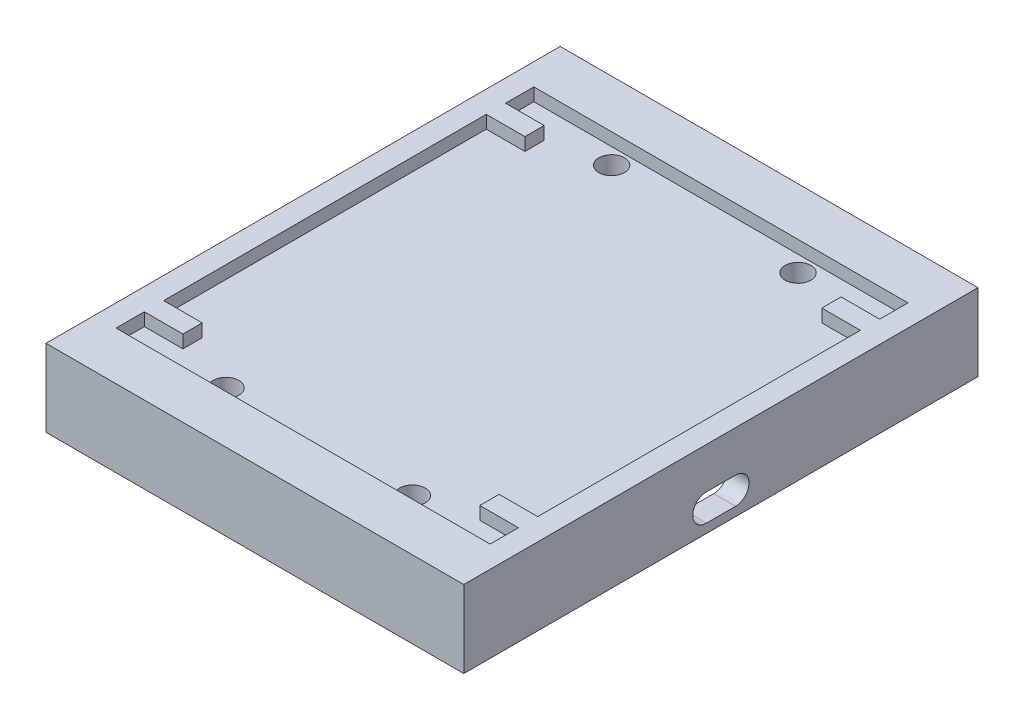
ISO-10303-21;
HEADER;
FILE_DESCRIPTION(('STEP AP214'),'2;1');
FILE_NAME('part.step','',(''),(''),'','','');
FILE_SCHEMA(('AUTOMOTIVE_DESIGN { 1 0 10303 214 1 1 1 1 }'));
ENDSEC;
DATA;
#1=APPLICATION_CONTEXT('core data for automotive mechanical design processes');
#2=APPLICATION_PROTOCOL_DEFINITION('international standard','automotive_design',2000,#1);
#3=PRODUCT_CONTEXT('',#1,'mechanical');
#4=PRODUCT('Part','Part','',(#3));
#5=PRODUCT_RELATED_PRODUCT_CATEGORY('part','',(#4));
#6=PRODUCT_DEFINITION_FORMATION('','',#4);
#7=PRODUCT_DEFINITION_CONTEXT('part definition',#1,'design');
#8=PRODUCT_DEFINITION('design','',#6,#7);
#9=PRODUCT_DEFINITION_SHAPE('','',#8);
#10=(LENGTH_UNIT() NAMED_UNIT(*) SI_UNIT(.MILLI.,.METRE.));
#11=(NAMED_UNIT(*) PLANE_ANGLE_UNIT() SI_UNIT($,.RADIAN.));
#12=(NAMED_UNIT(*) SI_UNIT($,.STERADIAN.) SOLID_ANGLE_UNIT());
#13=UNCERTAINTY_MEASURE_WITH_UNIT(LENGTH_MEASURE(1.E-05),#10,'distance_accuracy_value','');
#14=(GEOMETRIC_REPRESENTATION_CONTEXT(3) GLOBAL_UNCERTAINTY_ASSIGNED_CONTEXT((#13)) GLOBAL_UNIT_ASSIGNED_CONTEXT((#10,
#11,#12)) REPRESENTATION_CONTEXT('',''));
#15=CARTESIAN_POINT('',(0.,0.,0.));
#16=DIRECTION('',(0.,0.,1.));
#17=DIRECTION('',(1.,0.,0.));
#18=AXIS2_PLACEMENT_3D('',#15,#16,#17);
#19=CARTESIAN_POINT('',(0.,10.,0.));
#20=DIRECTION('',(0.,1.,0.));
#21=DIRECTION('',(0.,0.,1.));
#22=AXIS2_PLACEMENT_3D('',#19,#20,#21);
#23=PLANE('',#22);
#24=CARTESIAN_POINT('',(14.5,10.,30.));
#25=DIRECTION('',(0.,1.,0.));
#26=DIRECTION('',(0.,0.,-1.));
#27=AXIS2_PLACEMENT_3D('',#24,#25,#26);
#28=CIRCLE('',#27,2.);
#29=CARTESIAN_POINT('',(14.5,10.,28.));
#30=VERTEX_POINT('',#29);
#31=EDGE_CURVE('E420',#30,#30,#28,.T.);
#32=ORIENTED_EDGE('',*,*,#31,.F.);
#33=EDGE_LOOP('',(#32));
#34=FACE_BOUND('',#33,.T.);
#35=CARTESIAN_POINT('',(-14.5,10.,30.));
#36=DIRECTION('',(0.,1.,0.));
#37=DIRECTION('',(0.,0.,1.));
#38=AXIS2_PLACEMENT_3D('',#35,#36,#37);
#39=CIRCLE('',#38,2.);
#40=CARTESIAN_POINT('',(-14.5,10.,32.));
#41=VERTEX_POINT('',#40);
#42=EDGE_CURVE('E425',#41,#41,#39,.T.);
#43=ORIENTED_EDGE('',*,*,#42,.F.);
#44=EDGE_LOOP('',(#43));
#45=FACE_BOUND('',#44,.T.);
#46=CARTESIAN_POINT('',(-14.5,10.,-30.));
#47=DIRECTION('',(0.,1.,0.));
#48=DIRECTION('',(0.,0.,-1.));
#49=AXIS2_PLACEMENT_3D('',#46,#47,#48);
#50=CIRCLE('',#49,2.);
#51=CARTESIAN_POINT('',(-14.5,10.,-32.));
#52=VERTEX_POINT('',#51);
#53=EDGE_CURVE('E421',#52,#52,#50,.T.);
#54=ORIENTED_EDGE('',*,*,#53,.F.);
#55=EDGE_LOOP('',(#54));
#56=FACE_BOUND('',#55,.T.);
#57=CARTESIAN_POINT('',(14.5,10.,-30.));
#58=DIRECTION('',(0.,1.,0.));
#59=DIRECTION('',(0.,0.,1.));
#60=AXIS2_PLACEMENT_3D('',#57,#58,#59);
#61=CIRCLE('',#60,2.);
#62=CARTESIAN_POINT('',(14.5,10.,-28.));
#63=VERTEX_POINT('',#62);
#64=EDGE_CURVE('E424',#63,#63,#61,.T.);
#65=ORIENTED_EDGE('',*,*,#64,.F.);
#66=EDGE_LOOP('',(#65));
#67=FACE_BOUND('',#66,.T.);
#68=DIRECTION('',(0.,0.,1.));
#69=VECTOR('',#68,1.);
#70=CARTESIAN_POINT('',(-29.1,10.,-32.5));
#71=LINE('',#70,#69);
#72=CARTESIAN_POINT('',(-29.1,10.,-32.5));
#73=VERTEX_POINT('',#72);
#74=CARTESIAN_POINT('',(-29.1,10.,-28.1));
#75=VERTEX_POINT('',#74);
#76=EDGE_CURVE('E442',#73,#75,#71,.T.);
#77=ORIENTED_EDGE('',*,*,#76,.T.);
#78=DIRECTION('',(-1.,0.,0.));
#79=VECTOR('',#78,1.);
#80=CARTESIAN_POINT('',(-23.1,9.99999999999992,-28.1));
#81=LINE('',#80,#79);
#82=CARTESIAN_POINT('',(-23.1,10.,-28.1));
#83=VERTEX_POINT('',#82);
#84=EDGE_CURVE('E55',#83,#75,#81,.T.);
#85=ORIENTED_EDGE('',*,*,#84,.F.);
#86=DIRECTION('',(0.,0.,-1.));
#87=VECTOR('',#86,1.);
#88=CARTESIAN_POINT('',(-23.1,9.99999999999992,-28.1));
#89=LINE('',#88,#87);
#90=CARTESIAN_POINT('',(-23.1,10.,-25.1));
#91=VERTEX_POINT('',#90);
#92=EDGE_CURVE('E50',#91,#83,#89,.T.);
#93=ORIENTED_EDGE('',*,*,#92,.F.);
#94=DIRECTION('',(-1.,0.,0.));
#95=VECTOR('',#94,1.);
#96=CARTESIAN_POINT('',(-23.1,9.99999999999993,-25.1));
#97=LINE('',#96,#95);
#98=CARTESIAN_POINT('',(-29.1,10.,-25.1));
#99=VERTEX_POINT('',#98);
#100=EDGE_CURVE('E270',#91,#99,#97,.T.);
#101=ORIENTED_EDGE('',*,*,#100,.T.);
#102=CARTESIAN_POINT('',(-29.1,10.,25.1));
#103=VERTEX_POINT('',#102);
#104=EDGE_CURVE('E445',#99,#103,#71,.T.);
#105=ORIENTED_EDGE('',*,*,#104,.T.);
#106=DIRECTION('',(-1.,0.,0.));
#107=VECTOR('',#106,1.);
#108=CARTESIAN_POINT('',(-23.1,10.,25.1));
#109=LINE('',#108,#107);
#110=CARTESIAN_POINT('',(-23.1,10.,25.1));
#111=VERTEX_POINT('',#110);
#112=EDGE_CURVE('E284',#111,#103,#109,.T.);
#113=ORIENTED_EDGE('',*,*,#112,.F.);
#114=DIRECTION('',(0.,0.,-1.));
#115=VECTOR('',#114,1.);
#116=CARTESIAN_POINT('',(-23.1,10.,28.1));
#117=LINE('',#116,#115);
#118=CARTESIAN_POINT('',(-23.1,10.,28.1));
#119=VERTEX_POINT('',#118);
#120=EDGE_CURVE('E282',#119,#111,#117,.T.);
#121=ORIENTED_EDGE('',*,*,#120,.F.);
#122=DIRECTION('',(-1.,0.,0.));
#123=VECTOR('',#122,1.);
#124=CARTESIAN_POINT('',(-23.1,10.,28.1));
#125=LINE('',#124,#123);
#126=CARTESIAN_POINT('',(-29.1,10.,28.1));
#127=VERTEX_POINT('',#126);
#128=EDGE_CURVE('E290',#119,#127,#125,.T.);
#129=ORIENTED_EDGE('',*,*,#128,.T.);
#130=CARTESIAN_POINT('',(-29.1,10.,32.5));
#131=VERTEX_POINT('',#130);
#132=EDGE_CURVE('E441',#127,#131,#71,.T.);
#133=ORIENTED_EDGE('',*,*,#132,.T.);
#134=DIRECTION('',(1.,0.,0.));
#135=VECTOR('',#134,1.);
#136=CARTESIAN_POINT('',(-29.1,10.,32.5));
#137=LINE('',#136,#135);
#138=CARTESIAN_POINT('',(29.1,10.,32.5));
#139=VERTEX_POINT('',#138);
#140=EDGE_CURVE('E444',#131,#139,#137,.T.);
#141=ORIENTED_EDGE('',*,*,#140,.T.);
#142=DIRECTION('',(0.,0.,-1.));
#143=VECTOR('',#142,1.);
#144=CARTESIAN_POINT('',(29.1,10.,-32.5));
#145=LINE('',#144,#143);
#146=CARTESIAN_POINT('',(29.1,10.,28.1));
#147=VERTEX_POINT('',#146);
#148=EDGE_CURVE('E433',#139,#147,#145,.T.);
#149=ORIENTED_EDGE('',*,*,#148,.T.);
#150=DIRECTION('',(1.,0.,0.));
#151=VECTOR('',#150,1.);
#152=CARTESIAN_POINT('',(23.1,10.0000000000001,28.1));
#153=LINE('',#152,#151);
#154=CARTESIAN_POINT('',(23.1,10.,28.1));
#155=VERTEX_POINT('',#154);
#156=EDGE_CURVE('E321',#155,#147,#153,.T.);
#157=ORIENTED_EDGE('',*,*,#156,.F.);
#158=DIRECTION('',(0.,0.,1.));
#159=VECTOR('',#158,1.);
#160=CARTESIAN_POINT('',(23.1,10.,25.1));
#161=LINE('',#160,#159);
#162=CARTESIAN_POINT('',(23.1,10.,25.1));
#163=VERTEX_POINT('',#162);
#164=EDGE_CURVE('E303',#163,#155,#161,.T.);
#165=ORIENTED_EDGE('',*,*,#164,.F.);
#166=DIRECTION('',(1.,0.,0.));
#167=VECTOR('',#166,1.);
#168=CARTESIAN_POINT('',(23.1,10.,25.1));
#169=LINE('',#168,#167);
#170=CARTESIAN_POINT('',(29.1,10.,25.1));
#171=VERTEX_POINT('',#170);
#172=EDGE_CURVE('E324',#163,#171,#169,.T.);
#173=ORIENTED_EDGE('',*,*,#172,.T.);
#174=CARTESIAN_POINT('',(29.1,10.,-25.1));
#175=VERTEX_POINT('',#174);
#176=EDGE_CURVE('E437',#171,#175,#145,.T.);
#177=ORIENTED_EDGE('',*,*,#176,.T.);
#178=DIRECTION('',(1.,0.,0.));
#179=VECTOR('',#178,1.);
#180=CARTESIAN_POINT('',(23.1,10.,-25.1));
#181=LINE('',#180,#179);
#182=CARTESIAN_POINT('',(23.1,10.,-25.1));
#183=VERTEX_POINT('',#182);
#184=EDGE_CURVE('E345',#183,#175,#181,.T.);
#185=ORIENTED_EDGE('',*,*,#184,.F.);
#186=DIRECTION('',(0.,0.,1.));
#187=VECTOR('',#186,1.);
#188=CARTESIAN_POINT('',(23.1,10.,-25.1));
#189=LINE('',#188,#187);
#190=CARTESIAN_POINT('',(23.1,10.,-28.1));
#191=VERTEX_POINT('',#190);
#192=EDGE_CURVE('E330',#191,#183,#189,.T.);
#193=ORIENTED_EDGE('',*,*,#192,.F.);
#194=DIRECTION('',(1.,0.,0.));
#195=VECTOR('',#194,1.);
#196=CARTESIAN_POINT('',(23.1,10.,-28.1));
#197=LINE('',#196,#195);
#198=CARTESIAN_POINT('',(29.1,10.,-28.1));
#199=VERTEX_POINT('',#198);
#200=EDGE_CURVE('E348',#191,#199,#197,.T.);
#201=ORIENTED_EDGE('',*,*,#200,.T.);
#202=CARTESIAN_POINT('',(29.1,10.,-32.5));
#203=VERTEX_POINT('',#202);
#204=EDGE_CURVE('E438',#199,#203,#145,.T.);
#205=ORIENTED_EDGE('',*,*,#204,.T.);
#206=DIRECTION('',(-1.,0.,0.));
#207=VECTOR('',#206,1.);
#208=CARTESIAN_POINT('',(-29.1,10.,-32.5));
#209=LINE('',#208,#207);
#210=EDGE_CURVE('E436',#203,#73,#209,.T.);
#211=ORIENTED_EDGE('',*,*,#210,.T.);
#212=EDGE_LOOP('',(#77,#85,#93,#101,#105,#113,#121,#129,#133,#141,#149,#157,#165,#173,#177,#185,
#193,#201,#205,#211));
#213=FACE_BOUND('',#212,.T.);
#214=ADVANCED_FACE('F33',(#34,#45,#56,#67,#213),#23,.T.);
#215=CARTESIAN_POINT('',(-29.1,10.,-32.5));
#216=DIRECTION('',(-1.,0.,0.));
#217=DIRECTION('',(0.,0.,1.));
#218=AXIS2_PLACEMENT_3D('',#215,#216,#217);
#219=PLANE('',#218);
#220=DIRECTION('',(0.,1.,0.));
#221=VECTOR('',#220,1.);
#222=CARTESIAN_POINT('',(-29.1,11.9999999999999,-28.1));
#223=LINE('',#222,#221);
#224=CARTESIAN_POINT('',(-29.1,12.,-28.1));
#225=VERTEX_POINT('',#224);
#226=EDGE_CURVE('E264',#75,#225,#223,.T.);
#227=ORIENTED_EDGE('',*,*,#226,.F.);
#228=ORIENTED_EDGE('',*,*,#76,.F.);
#229=DIRECTION('',(0.,1.,0.));
#230=VECTOR('',#229,1.);
#231=CARTESIAN_POINT('',(-29.1,10.,-32.5));
#232=LINE('',#231,#230);
#233=CARTESIAN_POINT('',(-29.1,12.,-32.5));
#234=VERTEX_POINT('',#233);
#235=EDGE_CURVE('E468',#73,#234,#232,.T.);
#236=ORIENTED_EDGE('',*,*,#235,.T.);
#237=DIRECTION('',(0.,0.,1.));
#238=VECTOR('',#237,1.);
#239=CARTESIAN_POINT('',(-29.1,12.,-32.5));
#240=LINE('',#239,#238);
#241=EDGE_CURVE('E456',#234,#225,#240,.T.);
#242=ORIENTED_EDGE('',*,*,#241,.T.);
#243=EDGE_LOOP('',(#227,#228,#236,#242));
#244=FACE_BOUND('',#243,.T.);
#245=ADVANCED_FACE('F530',(#244),#219,.F.);
#246=DIRECTION('',(0.,-1.,0.));
#247=VECTOR('',#246,1.);
#248=CARTESIAN_POINT('',(-29.1,11.9999999999999,-25.1));
#249=LINE('',#248,#247);
#250=CARTESIAN_POINT('',(-29.1,11.9999999999999,-25.1));
#251=VERTEX_POINT('',#250);
#252=EDGE_CURVE('E261',#251,#99,#249,.T.);
#253=ORIENTED_EDGE('',*,*,#252,.F.);
#254=CARTESIAN_POINT('',(-29.1,12.,25.1));
#255=VERTEX_POINT('',#254);
#256=EDGE_CURVE('E459',#251,#255,#240,.T.);
#257=ORIENTED_EDGE('',*,*,#256,.T.);
#258=DIRECTION('',(0.,1.,0.));
#259=VECTOR('',#258,1.);
#260=CARTESIAN_POINT('',(-29.1,12.,25.1));
#261=LINE('',#260,#259);
#262=EDGE_CURVE('E265',#103,#255,#261,.T.);
#263=ORIENTED_EDGE('',*,*,#262,.F.);
#264=ORIENTED_EDGE('',*,*,#104,.F.);
#265=EDGE_LOOP('',(#253,#257,#263,#264));
#266=FACE_BOUND('',#265,.T.);
#267=ADVANCED_FACE('F536',(#266),#219,.F.);
#268=DIRECTION('',(0.,-1.,0.));
#269=VECTOR('',#268,1.);
#270=CARTESIAN_POINT('',(-29.1,12.,28.1));
#271=LINE('',#270,#269);
#272=CARTESIAN_POINT('',(-29.1,12.,28.1));
#273=VERTEX_POINT('',#272);
#274=EDGE_CURVE('E268',#273,#127,#271,.T.);
#275=ORIENTED_EDGE('',*,*,#274,.F.);
#276=CARTESIAN_POINT('',(-29.1,12.,32.5));
#277=VERTEX_POINT('',#276);
#278=EDGE_CURVE('E455',#273,#277,#240,.T.);
#279=ORIENTED_EDGE('',*,*,#278,.T.);
#280=DIRECTION('',(0.,1.,0.));
#281=VECTOR('',#280,1.);
#282=CARTESIAN_POINT('',(-29.1,10.,32.5));
#283=LINE('',#282,#281);
#284=EDGE_CURVE('E465',#131,#277,#283,.T.);
#285=ORIENTED_EDGE('',*,*,#284,.F.);
#286=ORIENTED_EDGE('',*,*,#132,.F.);
#287=EDGE_LOOP('',(#275,#279,#285,#286));
#288=FACE_BOUND('',#287,.T.);
#289=ADVANCED_FACE('F539',(#288),#219,.F.);
#290=CARTESIAN_POINT('',(29.1,10.,-32.5));
#291=DIRECTION('',(1.,0.,0.));
#292=DIRECTION('',(0.,0.,-1.));
#293=AXIS2_PLACEMENT_3D('',#290,#291,#292);
#294=PLANE('',#293);
#295=DIRECTION('',(0.,-1.,0.));
#296=VECTOR('',#295,1.);
#297=CARTESIAN_POINT('',(29.1,12.,25.1));
#298=LINE('',#297,#296);
#299=CARTESIAN_POINT('',(29.1,12.,25.1));
#300=VERTEX_POINT('',#299);
#301=EDGE_CURVE('E299',#300,#171,#298,.T.);
#302=ORIENTED_EDGE('',*,*,#301,.F.);
#303=DIRECTION('',(0.,0.,-1.));
#304=VECTOR('',#303,1.);
#305=CARTESIAN_POINT('',(29.1,12.,-32.5));
#306=LINE('',#305,#304);
#307=CARTESIAN_POINT('',(29.1,12.,-25.1));
#308=VERTEX_POINT('',#307);
#309=EDGE_CURVE('E452',#300,#308,#306,.T.);
#310=ORIENTED_EDGE('',*,*,#309,.T.);
#311=DIRECTION('',(0.,1.,0.));
#312=VECTOR('',#311,1.);
#313=CARTESIAN_POINT('',(29.1,12.,-25.1));
#314=LINE('',#313,#312);
#315=EDGE_CURVE('E331',#175,#308,#314,.T.);
#316=ORIENTED_EDGE('',*,*,#315,.F.);
#317=ORIENTED_EDGE('',*,*,#176,.F.);
#318=EDGE_LOOP('',(#302,#310,#316,#317));
#319=FACE_BOUND('',#318,.T.);
#320=ADVANCED_FACE('F552',(#319),#294,.F.);
#321=DIRECTION('',(0.,1.,0.));
#322=VECTOR('',#321,1.);
#323=CARTESIAN_POINT('',(29.1,12.,28.1));
#324=LINE('',#323,#322);
#325=CARTESIAN_POINT('',(29.1,12.,28.1));
#326=VERTEX_POINT('',#325);
#327=EDGE_CURVE('E304',#147,#326,#324,.T.);
#328=ORIENTED_EDGE('',*,*,#327,.F.);
#329=ORIENTED_EDGE('',*,*,#148,.F.);
#330=DIRECTION('',(0.,1.,0.));
#331=VECTOR('',#330,1.);
#332=CARTESIAN_POINT('',(29.1,10.,32.5));
#333=LINE('',#332,#331);
#334=CARTESIAN_POINT('',(29.1,12.,32.5));
#335=VERTEX_POINT('',#334);
#336=EDGE_CURVE('E462',#139,#335,#333,.T.);
#337=ORIENTED_EDGE('',*,*,#336,.T.);
#338=EDGE_CURVE('E449',#335,#326,#306,.T.);
#339=ORIENTED_EDGE('',*,*,#338,.T.);
#340=EDGE_LOOP('',(#328,#329,#337,#339));
#341=FACE_BOUND('',#340,.T.);
#342=ADVANCED_FACE('F550',(#341),#294,.F.);
#343=DIRECTION('',(0.,-1.,0.));
#344=VECTOR('',#343,1.);
#345=CARTESIAN_POINT('',(29.1,12.,-28.1));
#346=LINE('',#345,#344);
#347=CARTESIAN_POINT('',(29.1,12.,-28.1));
#348=VERTEX_POINT('',#347);
#349=EDGE_CURVE('E326',#348,#199,#346,.T.);
#350=ORIENTED_EDGE('',*,*,#349,.F.);
#351=CARTESIAN_POINT('',(29.1,12.,-32.5));
#352=VERTEX_POINT('',#351);
#353=EDGE_CURVE('E432',#348,#352,#306,.T.);
#354=ORIENTED_EDGE('',*,*,#353,.T.);
#355=DIRECTION('',(0.,1.,0.));
#356=VECTOR('',#355,1.);
#357=CARTESIAN_POINT('',(29.1,10.,-32.5));
#358=LINE('',#357,#356);
#359=EDGE_CURVE('E448',#203,#352,#358,.T.);
#360=ORIENTED_EDGE('',*,*,#359,.F.);
#361=ORIENTED_EDGE('',*,*,#204,.F.);
#362=EDGE_LOOP('',(#350,#354,#360,#361));
#363=FACE_BOUND('',#362,.T.);
#364=ADVANCED_FACE('F548',(#363),#294,.F.);
#365=CARTESIAN_POINT('',(0.,0.,0.));
#366=DIRECTION('',(0.,-1.,0.));
#367=DIRECTION('',(0.,0.,-1.));
#368=AXIS2_PLACEMENT_3D('',#365,#366,#367);
#369=PLANE('',#368);
#370=DIRECTION('',(1.,0.,0.));
#371=VECTOR('',#370,1.);
#372=CARTESIAN_POINT('',(-32.5,0.,-40.));
#373=LINE('',#372,#371);
#374=CARTESIAN_POINT('',(-32.5,0.,-40.));
#375=VERTEX_POINT('',#374);
#376=CARTESIAN_POINT('',(32.5,0.,-40.));
#377=VERTEX_POINT('',#376);
#378=EDGE_CURVE('E464',#375,#377,#373,.T.);
#379=ORIENTED_EDGE('',*,*,#378,.T.);
#380=DIRECTION('',(0.,0.,1.));
#381=VECTOR('',#380,1.);
#382=CARTESIAN_POINT('',(32.5,0.,-40.));
#383=LINE('',#382,#381);
#384=CARTESIAN_POINT('',(32.5,0.,40.));
#385=VERTEX_POINT('',#384);
#386=EDGE_CURVE('E486',#377,#385,#383,.T.);
#387=ORIENTED_EDGE('',*,*,#386,.T.);
#388=DIRECTION('',(1.,0.,0.));
#389=VECTOR('',#388,1.);
#390=CARTESIAN_POINT('',(-32.5,0.,40.));
#391=LINE('',#390,#389);
#392=CARTESIAN_POINT('',(-32.5,0.,40.));
#393=VERTEX_POINT('',#392);
#394=EDGE_CURVE('E489',#393,#385,#391,.T.);
#395=ORIENTED_EDGE('',*,*,#394,.F.);
#396=DIRECTION('',(0.,0.,1.));
#397=VECTOR('',#396,1.);
#398=CARTESIAN_POINT('',(-32.5,0.,-40.));
#399=LINE('',#398,#397);
#400=EDGE_CURVE('E476',#375,#393,#399,.T.);
#401=ORIENTED_EDGE('',*,*,#400,.F.);
#402=EDGE_LOOP('',(#379,#387,#395,#401));
#403=FACE_BOUND('',#402,.T.);
#404=DIRECTION('',(1.,0.,0.));
#405=VECTOR('',#404,1.);
#406=CARTESIAN_POINT('',(-29.1,0.,32.5));
#407=LINE('',#406,#405);
#408=CARTESIAN_POINT('',(-29.1,0.,32.5));
#409=VERTEX_POINT('',#408);
#410=CARTESIAN_POINT('',(29.1,0.,32.5));
#411=VERTEX_POINT('',#410);
#412=EDGE_CURVE('E385',#409,#411,#407,.T.);
#413=ORIENTED_EDGE('',*,*,#412,.T.);
#414=DIRECTION('',(0.,0.,-1.));
#415=VECTOR('',#414,1.);
#416=CARTESIAN_POINT('',(29.1,0.,-32.5));
#417=LINE('',#416,#415);
#418=CARTESIAN_POINT('',(29.1,0.,-32.5));
#419=VERTEX_POINT('',#418);
#420=EDGE_CURVE('E380',#411,#419,#417,.T.);
#421=ORIENTED_EDGE('',*,*,#420,.T.);
#422=DIRECTION('',(-1.,0.,0.));
#423=VECTOR('',#422,1.);
#424=CARTESIAN_POINT('',(-29.1,0.,-32.5));
#425=LINE('',#424,#423);
#426=CARTESIAN_POINT('',(-29.1,0.,-32.5));
#427=VERTEX_POINT('',#426);
#428=EDGE_CURVE('E394',#419,#427,#425,.T.);
#429=ORIENTED_EDGE('',*,*,#428,.T.);
#430=DIRECTION('',(0.,0.,1.));
#431=VECTOR('',#430,1.);
#432=CARTESIAN_POINT('',(-29.1,0.,-32.5));
#433=LINE('',#432,#431);
#434=EDGE_CURVE('E397',#427,#409,#433,.T.);
#435=ORIENTED_EDGE('',*,*,#434,.T.);
#436=EDGE_LOOP('',(#413,#421,#429,#435));
#437=FACE_BOUND('',#436,.T.);
#438=ADVANCED_FACE('F507',(#403,#437),#369,.T.);
#439=CARTESIAN_POINT('',(-32.5,12.,-40.));
#440=DIRECTION('',(0.,0.,-1.));
#441=DIRECTION('',(-1.,0.,0.));
#442=AXIS2_PLACEMENT_3D('',#439,#440,#441);
#443=PLANE('',#442);
#444=ORIENTED_EDGE('',*,*,#378,.F.);
#445=DIRECTION('',(0.,-1.,0.));
#446=VECTOR('',#445,1.);
#447=CARTESIAN_POINT('',(-32.5,12.,-40.));
#448=LINE('',#447,#446);
#449=CARTESIAN_POINT('',(-32.5,12.,-40.));
#450=VERTEX_POINT('',#449);
#451=EDGE_CURVE('E11',#450,#375,#448,.T.);
#452=ORIENTED_EDGE('',*,*,#451,.F.);
#453=DIRECTION('',(1.,0.,0.));
#454=VECTOR('',#453,1.);
#455=CARTESIAN_POINT('',(-32.5,12.,-40.));
#456=LINE('',#455,#454);
#457=CARTESIAN_POINT('',(32.5,12.,-40.));
#458=VERTEX_POINT('',#457);
#459=EDGE_CURVE('E472',#450,#458,#456,.T.);
#460=ORIENTED_EDGE('',*,*,#459,.T.);
#461=DIRECTION('',(0.,-1.,0.));
#462=VECTOR('',#461,1.);
#463=CARTESIAN_POINT('',(32.5,12.,-40.));
#464=LINE('',#463,#462);
#465=EDGE_CURVE('E483',#458,#377,#464,.T.);
#466=ORIENTED_EDGE('',*,*,#465,.T.);
#467=EDGE_LOOP('',(#444,#452,#460,#466));
#468=FACE_BOUND('',#467,.T.);
#469=ADVANCED_FACE('F35',(#468),#443,.T.);
#470=CARTESIAN_POINT('',(-32.5,12.,-40.));
#471=DIRECTION('',(1.,0.,0.));
#472=DIRECTION('',(0.,0.,-1.));
#473=AXIS2_PLACEMENT_3D('',#470,#471,#472);
#474=PLANE('',#473);
#475=ORIENTED_EDGE('',*,*,#400,.T.);
#476=DIRECTION('',(0.,-1.,0.));
#477=VECTOR('',#476,1.);
#478=CARTESIAN_POINT('',(-32.5,12.,40.));
#479=LINE('',#478,#477);
#480=CARTESIAN_POINT('',(-32.5,12.,40.));
#481=VERTEX_POINT('',#480);
#482=EDGE_CURVE('E42',#481,#393,#479,.T.);
#483=ORIENTED_EDGE('',*,*,#482,.F.);
#484=DIRECTION('',(0.,0.,1.));
#485=VECTOR('',#484,1.);
#486=CARTESIAN_POINT('',(-32.5,12.,-40.));
#487=LINE('',#486,#485);
#488=EDGE_CURVE('E481',#450,#481,#487,.T.);
#489=ORIENTED_EDGE('',*,*,#488,.F.);
#490=ORIENTED_EDGE('',*,*,#451,.T.);
#491=EDGE_LOOP('',(#475,#483,#489,#490));
#492=FACE_BOUND('',#491,.T.);
#493=ADVANCED_FACE('F511',(#492),#474,.F.);
#494=CARTESIAN_POINT('',(-32.5,12.,40.));
#495=DIRECTION('',(0.,0.,-1.));
#496=DIRECTION('',(-1.,0.,0.));
#497=AXIS2_PLACEMENT_3D('',#494,#495,#496);
#498=PLANE('',#497);
#499=ORIENTED_EDGE('',*,*,#394,.T.);
#500=DIRECTION('',(0.,-1.,0.));
#501=VECTOR('',#500,1.);
#502=CARTESIAN_POINT('',(32.5,12.,40.));
#503=LINE('',#502,#501);
#504=CARTESIAN_POINT('',(32.5,12.,40.));
#505=VERTEX_POINT('',#504);
#506=EDGE_CURVE('E495',#505,#385,#503,.T.);
#507=ORIENTED_EDGE('',*,*,#506,.F.);
#508=DIRECTION('',(1.,0.,0.));
#509=VECTOR('',#508,1.);
#510=CARTESIAN_POINT('',(-32.5,12.,40.));
#511=LINE('',#510,#509);
#512=EDGE_CURVE('E479',#481,#505,#511,.T.);
#513=ORIENTED_EDGE('',*,*,#512,.F.);
#514=ORIENTED_EDGE('',*,*,#482,.T.);
#515=EDGE_LOOP('',(#499,#507,#513,#514));
#516=FACE_BOUND('',#515,.T.);
#517=ADVANCED_FACE('F515',(#516),#498,.F.);
#518=CARTESIAN_POINT('',(32.5,12.,-40.));
#519=DIRECTION('',(1.,0.,0.));
#520=DIRECTION('',(0.,0.,-1.));
#521=AXIS2_PLACEMENT_3D('',#518,#519,#520);
#522=PLANE('',#521);
#523=CARTESIAN_POINT('',(32.5,3.5,-2.27769030233649));
#524=DIRECTION('',(1.,0.,0.));
#525=DIRECTION('',(0.,0.,-1.));
#526=AXIS2_PLACEMENT_3D('',#523,#524,#525);
#527=CIRCLE('',#526,2.10143076838881);
#528=CARTESIAN_POINT('',(32.5,1.39856923161119,-2.27769030233649));
#529=VERTEX_POINT('',#528);
#530=CARTESIAN_POINT('',(32.5,5.60143076838881,-2.27769030233649));
#531=VERTEX_POINT('',#530);
#532=EDGE_CURVE('E378',#529,#531,#527,.T.);
#533=ORIENTED_EDGE('',*,*,#532,.F.);
#534=DIRECTION('',(0.,0.,-1.));
#535=VECTOR('',#534,1.);
#536=CARTESIAN_POINT('',(32.5,1.39856923161119,-40.));
#537=LINE('',#536,#535);
#538=CARTESIAN_POINT('',(32.5,1.39856923161119,2.27769030233649));
#539=VERTEX_POINT('',#538);
#540=EDGE_CURVE('E365',#539,#529,#537,.T.);
#541=ORIENTED_EDGE('',*,*,#540,.F.);
#542=CARTESIAN_POINT('',(32.5,3.5,2.27769030233649));
#543=DIRECTION('',(1.,0.,0.));
#544=DIRECTION('',(0.,0.,-1.));
#545=AXIS2_PLACEMENT_3D('',#542,#543,#544);
#546=CIRCLE('',#545,2.10143076838881);
#547=CARTESIAN_POINT('',(32.5,5.60143076838881,2.27769030233649));
#548=VERTEX_POINT('',#547);
#549=EDGE_CURVE('E373',#548,#539,#546,.T.);
#550=ORIENTED_EDGE('',*,*,#549,.F.);
#551=DIRECTION('',(0.,0.,1.));
#552=VECTOR('',#551,1.);
#553=CARTESIAN_POINT('',(32.5,5.60143076838881,-40.));
#554=LINE('',#553,#552);
#555=EDGE_CURVE('E376',#531,#548,#554,.T.);
#556=ORIENTED_EDGE('',*,*,#555,.F.);
#557=EDGE_LOOP('',(#533,#541,#550,#556));
#558=FACE_BOUND('',#557,.T.);
#559=ORIENTED_EDGE('',*,*,#386,.F.);
#560=ORIENTED_EDGE('',*,*,#465,.F.);
#561=DIRECTION('',(0.,0.,1.));
#562=VECTOR('',#561,1.);
#563=CARTESIAN_POINT('',(32.5,12.,-40.));
#564=LINE('',#563,#562);
#565=EDGE_CURVE('E475',#458,#505,#564,.T.);
#566=ORIENTED_EDGE('',*,*,#565,.T.);
#567=ORIENTED_EDGE('',*,*,#506,.T.);
#568=EDGE_LOOP('',(#559,#560,#566,#567));
#569=FACE_BOUND('',#568,.T.);
#570=ADVANCED_FACE('F502',(#558,#569),#522,.T.);
#571=CARTESIAN_POINT('',(0.,12.,0.));
#572=DIRECTION('',(0.,-1.,0.));
#573=DIRECTION('',(0.,0.,-1.));
#574=AXIS2_PLACEMENT_3D('',#571,#572,#573);
#575=PLANE('',#574);
#576=DIRECTION('',(-1.,0.,0.));
#577=VECTOR('',#576,1.);
#578=CARTESIAN_POINT('',(-29.1,12.,-32.5));
#579=LINE('',#578,#577);
#580=EDGE_CURVE('E451',#352,#234,#579,.T.);
#581=ORIENTED_EDGE('',*,*,#580,.F.);
#582=ORIENTED_EDGE('',*,*,#353,.F.);
#583=DIRECTION('',(1.,0.,0.));
#584=VECTOR('',#583,1.);
#585=CARTESIAN_POINT('',(23.1,12.,-28.1));
#586=LINE('',#585,#584);
#587=CARTESIAN_POINT('',(23.1,12.,-28.1));
#588=VERTEX_POINT('',#587);
#589=EDGE_CURVE('E337',#588,#348,#586,.T.);
#590=ORIENTED_EDGE('',*,*,#589,.F.);
#591=DIRECTION('',(0.,0.,-1.));
#592=VECTOR('',#591,1.);
#593=CARTESIAN_POINT('',(23.1,12.,-25.1));
#594=LINE('',#593,#592);
#595=CARTESIAN_POINT('',(23.1,12.,-25.1));
#596=VERTEX_POINT('',#595);
#597=EDGE_CURVE('E335',#596,#588,#594,.T.);
#598=ORIENTED_EDGE('',*,*,#597,.F.);
#599=DIRECTION('',(1.,0.,0.));
#600=VECTOR('',#599,1.);
#601=CARTESIAN_POINT('',(23.1,12.,-25.1));
#602=LINE('',#601,#600);
#603=EDGE_CURVE('E342',#596,#308,#602,.T.);
#604=ORIENTED_EDGE('',*,*,#603,.T.);
#605=ORIENTED_EDGE('',*,*,#309,.F.);
#606=DIRECTION('',(1.,0.,0.));
#607=VECTOR('',#606,1.);
#608=CARTESIAN_POINT('',(23.1,12.,25.1));
#609=LINE('',#608,#607);
#610=CARTESIAN_POINT('',(23.1,12.,25.1));
#611=VERTEX_POINT('',#610);
#612=EDGE_CURVE('E311',#611,#300,#609,.T.);
#613=ORIENTED_EDGE('',*,*,#612,.F.);
#614=DIRECTION('',(0.,0.,-1.));
#615=VECTOR('',#614,1.);
#616=CARTESIAN_POINT('',(23.1,12.,25.1));
#617=LINE('',#616,#615);
#618=CARTESIAN_POINT('',(23.1,12.,28.1));
#619=VERTEX_POINT('',#618);
#620=EDGE_CURVE('E309',#619,#611,#617,.T.);
#621=ORIENTED_EDGE('',*,*,#620,.F.);
#622=DIRECTION('',(1.,0.,0.));
#623=VECTOR('',#622,1.);
#624=CARTESIAN_POINT('',(23.1,12.,28.1));
#625=LINE('',#624,#623);
#626=EDGE_CURVE('E318',#619,#326,#625,.T.);
#627=ORIENTED_EDGE('',*,*,#626,.T.);
#628=ORIENTED_EDGE('',*,*,#338,.F.);
#629=DIRECTION('',(1.,0.,0.));
#630=VECTOR('',#629,1.);
#631=CARTESIAN_POINT('',(-29.1,12.,32.5));
#632=LINE('',#631,#630);
#633=EDGE_CURVE('E458',#277,#335,#632,.T.);
#634=ORIENTED_EDGE('',*,*,#633,.F.);
#635=ORIENTED_EDGE('',*,*,#278,.F.);
#636=DIRECTION('',(-1.,0.,0.));
#637=VECTOR('',#636,1.);
#638=CARTESIAN_POINT('',(-23.1,12.,28.1));
#639=LINE('',#638,#637);
#640=CARTESIAN_POINT('',(-23.1,12.,28.1));
#641=VERTEX_POINT('',#640);
#642=EDGE_CURVE('E293',#641,#273,#639,.T.);
#643=ORIENTED_EDGE('',*,*,#642,.F.);
#644=DIRECTION('',(0.,0.,1.));
#645=VECTOR('',#644,1.);
#646=CARTESIAN_POINT('',(-23.1,12.,28.1));
#647=LINE('',#646,#645);
#648=CARTESIAN_POINT('',(-23.1,12.,25.1));
#649=VERTEX_POINT('',#648);
#650=EDGE_CURVE('E277',#649,#641,#647,.T.);
#651=ORIENTED_EDGE('',*,*,#650,.F.);
#652=DIRECTION('',(-1.,0.,0.));
#653=VECTOR('',#652,1.);
#654=CARTESIAN_POINT('',(-23.1,12.,25.1));
#655=LINE('',#654,#653);
#656=EDGE_CURVE('E296',#649,#255,#655,.T.);
#657=ORIENTED_EDGE('',*,*,#656,.T.);
#658=ORIENTED_EDGE('',*,*,#256,.F.);
#659=DIRECTION('',(-1.,0.,0.));
#660=VECTOR('',#659,1.);
#661=CARTESIAN_POINT('',(-23.1,11.9999999999999,-25.1));
#662=LINE('',#661,#660);
#663=CARTESIAN_POINT('',(-23.1,11.9999999999999,-25.1));
#664=VERTEX_POINT('',#663);
#665=EDGE_CURVE('E252',#664,#251,#662,.T.);
#666=ORIENTED_EDGE('',*,*,#665,.F.);
#667=DIRECTION('',(0.,0.,1.));
#668=VECTOR('',#667,1.);
#669=CARTESIAN_POINT('',(-23.1,11.9999999999999,-28.1));
#670=LINE('',#669,#668);
#671=CARTESIAN_POINT('',(-23.1,11.9999999999999,-28.1));
#672=VERTEX_POINT('',#671);
#673=EDGE_CURVE('E242',#672,#664,#670,.T.);
#674=ORIENTED_EDGE('',*,*,#673,.F.);
#675=DIRECTION('',(-1.,0.,0.));
#676=VECTOR('',#675,1.);
#677=CARTESIAN_POINT('',(-23.1,11.9999999999999,-28.1));
#678=LINE('',#677,#676);
#679=EDGE_CURVE('E249',#672,#225,#678,.T.);
#680=ORIENTED_EDGE('',*,*,#679,.T.);
#681=ORIENTED_EDGE('',*,*,#241,.F.);
#682=EDGE_LOOP('',(#581,#582,#590,#598,#604,#605,#613,#621,#627,#628,#634,#635,#643,#651,#657,
#658,#666,#674,#680,#681));
#683=FACE_BOUND('',#682,.T.);
#684=ORIENTED_EDGE('',*,*,#459,.F.);
#685=ORIENTED_EDGE('',*,*,#488,.T.);
#686=ORIENTED_EDGE('',*,*,#512,.T.);
#687=ORIENTED_EDGE('',*,*,#565,.F.);
#688=EDGE_LOOP('',(#684,#685,#686,#687));
#689=FACE_BOUND('',#688,.T.);
#690=ADVANCED_FACE('F245',(#683,#689),#575,.F.);
#691=CARTESIAN_POINT('',(-29.1,10.,32.5));
#692=DIRECTION('',(0.,0.,1.));
#693=DIRECTION('',(1.,0.,0.));
#694=AXIS2_PLACEMENT_3D('',#691,#692,#693);
#695=PLANE('',#694);
#696=ORIENTED_EDGE('',*,*,#633,.T.);
#697=ORIENTED_EDGE('',*,*,#336,.F.);
#698=ORIENTED_EDGE('',*,*,#140,.F.);
#699=ORIENTED_EDGE('',*,*,#284,.T.);
#700=EDGE_LOOP('',(#696,#697,#698,#699));
#701=FACE_BOUND('',#700,.T.);
#702=ADVANCED_FACE('F517',(#701),#695,.F.);
#703=CARTESIAN_POINT('',(-29.1,10.,-32.5));
#704=DIRECTION('',(0.,0.,-1.));
#705=DIRECTION('',(-1.,0.,0.));
#706=AXIS2_PLACEMENT_3D('',#703,#704,#705);
#707=PLANE('',#706);
#708=ORIENTED_EDGE('',*,*,#580,.T.);
#709=ORIENTED_EDGE('',*,*,#235,.F.);
#710=ORIENTED_EDGE('',*,*,#210,.F.);
#711=ORIENTED_EDGE('',*,*,#359,.T.);
#712=EDGE_LOOP('',(#708,#709,#710,#711));
#713=FACE_BOUND('',#712,.T.);
#714=ADVANCED_FACE('F523',(#713),#707,.F.);
#715=CARTESIAN_POINT('',(14.5,0.,-30.));
#716=DIRECTION('',(0.,1.,0.));
#717=DIRECTION('',(0.,0.,1.));
#718=AXIS2_PLACEMENT_3D('',#715,#716,#717);
#719=CYLINDRICAL_SURFACE('',#718,2.);
#720=CARTESIAN_POINT('',(14.5,7.,-30.));
#721=DIRECTION('',(0.,1.,0.));
#722=DIRECTION('',(0.,0.,1.));
#723=AXIS2_PLACEMENT_3D('',#720,#721,#722);
#724=CIRCLE('',#723,2.);
#725=CARTESIAN_POINT('',(14.5,7.,-28.));
#726=VERTEX_POINT('',#725);
#727=EDGE_CURVE('E417',#726,#726,#724,.F.);
#728=ORIENTED_EDGE('',*,*,#727,.T.);
#729=EDGE_LOOP('',(#728));
#730=FACE_BOUND('',#729,.T.);
#731=ORIENTED_EDGE('',*,*,#64,.T.);
#732=EDGE_LOOP('',(#731));
#733=FACE_BOUND('',#732,.T.);
#734=ADVANCED_FACE('F543',(#730,#733),#719,.F.);
#735=CARTESIAN_POINT('',(-14.5,0.,-30.));
#736=DIRECTION('',(0.,1.,0.));
#737=DIRECTION('',(0.,0.,1.));
#738=AXIS2_PLACEMENT_3D('',#735,#736,#737);
#739=CYLINDRICAL_SURFACE('',#738,2.);
#740=CARTESIAN_POINT('',(-14.5,7.,-30.));
#741=DIRECTION('',(0.,1.,0.));
#742=DIRECTION('',(0.,0.,1.));
#743=AXIS2_PLACEMENT_3D('',#740,#741,#742);
#744=CIRCLE('',#743,2.);
#745=CARTESIAN_POINT('',(-14.5,7.,-28.));
#746=VERTEX_POINT('',#745);
#747=EDGE_CURVE('E414',#746,#746,#744,.F.);
#748=ORIENTED_EDGE('',*,*,#747,.T.);
#749=EDGE_LOOP('',(#748));
#750=FACE_BOUND('',#749,.T.);
#751=ORIENTED_EDGE('',*,*,#53,.T.);
#752=EDGE_LOOP('',(#751));
#753=FACE_BOUND('',#752,.T.);
#754=ADVANCED_FACE('F637',(#750,#753),#739,.F.);
#755=CARTESIAN_POINT('',(-14.5,0.,30.));
#756=DIRECTION('',(0.,1.,0.));
#757=DIRECTION('',(0.,0.,1.));
#758=AXIS2_PLACEMENT_3D('',#755,#756,#757);
#759=CYLINDRICAL_SURFACE('',#758,2.);
#760=CARTESIAN_POINT('',(-14.5,7.,30.));
#761=DIRECTION('',(0.,1.,0.));
#762=DIRECTION('',(0.,0.,1.));
#763=AXIS2_PLACEMENT_3D('',#760,#761,#762);
#764=CIRCLE('',#763,2.);
#765=CARTESIAN_POINT('',(-14.5,7.,32.));
#766=VERTEX_POINT('',#765);
#767=EDGE_CURVE('E411',#766,#766,#764,.F.);
#768=ORIENTED_EDGE('',*,*,#767,.T.);
#769=EDGE_LOOP('',(#768));
#770=FACE_BOUND('',#769,.T.);
#771=ORIENTED_EDGE('',*,*,#42,.T.);
#772=EDGE_LOOP('',(#771));
#773=FACE_BOUND('',#772,.T.);
#774=ADVANCED_FACE('F640',(#770,#773),#759,.F.);
#775=CARTESIAN_POINT('',(14.5,0.,30.));
#776=DIRECTION('',(0.,1.,0.));
#777=DIRECTION('',(0.,0.,1.));
#778=AXIS2_PLACEMENT_3D('',#775,#776,#777);
#779=CYLINDRICAL_SURFACE('',#778,2.);
#780=CARTESIAN_POINT('',(14.5,7.,30.));
#781=DIRECTION('',(0.,1.,0.));
#782=DIRECTION('',(0.,0.,1.));
#783=AXIS2_PLACEMENT_3D('',#780,#781,#782);
#784=CIRCLE('',#783,2.);
#785=CARTESIAN_POINT('',(14.5,7.,32.));
#786=VERTEX_POINT('',#785);
#787=EDGE_CURVE('E37',#786,#786,#784,.F.);
#788=ORIENTED_EDGE('',*,*,#787,.T.);
#789=EDGE_LOOP('',(#788));
#790=FACE_BOUND('',#789,.T.);
#791=ORIENTED_EDGE('',*,*,#31,.T.);
#792=EDGE_LOOP('',(#791));
#793=FACE_BOUND('',#792,.T.);
#794=ADVANCED_FACE('F621',(#790,#793),#779,.F.);
#795=CARTESIAN_POINT('',(0.,7.,0.));
#796=DIRECTION('',(0.,1.,0.));
#797=DIRECTION('',(0.,0.,1.));
#798=AXIS2_PLACEMENT_3D('',#795,#796,#797);
#799=PLANE('',#798);
#800=ORIENTED_EDGE('',*,*,#747,.F.);
#801=EDGE_LOOP('',(#800));
#802=FACE_BOUND('',#801,.T.);
#803=ORIENTED_EDGE('',*,*,#787,.F.);
#804=EDGE_LOOP('',(#803));
#805=FACE_BOUND('',#804,.T.);
#806=DIRECTION('',(0.,0.,-1.));
#807=VECTOR('',#806,1.);
#808=CARTESIAN_POINT('',(29.1,7.,-32.5));
#809=LINE('',#808,#807);
#810=CARTESIAN_POINT('',(29.1,7.,32.5));
#811=VERTEX_POINT('',#810);
#812=CARTESIAN_POINT('',(29.1,7.,-32.5));
#813=VERTEX_POINT('',#812);
#814=EDGE_CURVE('E381',#811,#813,#809,.T.);
#815=ORIENTED_EDGE('',*,*,#814,.F.);
#816=DIRECTION('',(1.,0.,0.));
#817=VECTOR('',#816,1.);
#818=CARTESIAN_POINT('',(-29.1,7.,32.5));
#819=LINE('',#818,#817);
#820=CARTESIAN_POINT('',(-29.1,7.,32.5));
#821=VERTEX_POINT('',#820);
#822=EDGE_CURVE('E389',#821,#811,#819,.T.);
#823=ORIENTED_EDGE('',*,*,#822,.F.);
#824=DIRECTION('',(0.,0.,1.));
#825=VECTOR('',#824,1.);
#826=CARTESIAN_POINT('',(-29.1,7.,-32.5));
#827=LINE('',#826,#825);
#828=CARTESIAN_POINT('',(-29.1,7.,-32.5));
#829=VERTEX_POINT('',#828);
#830=EDGE_CURVE('E387',#829,#821,#827,.T.);
#831=ORIENTED_EDGE('',*,*,#830,.F.);
#832=DIRECTION('',(-1.,0.,0.));
#833=VECTOR('',#832,1.);
#834=CARTESIAN_POINT('',(-29.1,7.,-32.5));
#835=LINE('',#834,#833);
#836=EDGE_CURVE('E384',#813,#829,#835,.T.);
#837=ORIENTED_EDGE('',*,*,#836,.F.);
#838=EDGE_LOOP('',(#815,#823,#831,#837));
#839=FACE_BOUND('',#838,.T.);
#840=ORIENTED_EDGE('',*,*,#767,.F.);
#841=EDGE_LOOP('',(#840));
#842=FACE_BOUND('',#841,.T.);
#843=ORIENTED_EDGE('',*,*,#727,.F.);
#844=EDGE_LOOP('',(#843));
#845=FACE_BOUND('',#844,.T.);
#846=ADVANCED_FACE('F617',(#802,#805,#839,#842,#845),#799,.F.);
#847=CARTESIAN_POINT('',(29.1,7.,-32.5));
#848=DIRECTION('',(-1.,0.,0.));
#849=DIRECTION('',(0.,0.,1.));
#850=AXIS2_PLACEMENT_3D('',#847,#848,#849);
#851=PLANE('',#850);
#852=CARTESIAN_POINT('',(29.1,3.5,-2.27769030233649));
#853=DIRECTION('',(-1.,0.,0.));
#854=DIRECTION('',(0.,0.,1.));
#855=AXIS2_PLACEMENT_3D('',#852,#853,#854);
#856=CIRCLE('',#855,2.10143076838881);
#857=CARTESIAN_POINT('',(29.1,5.60143076838881,-2.27769030233649));
#858=VERTEX_POINT('',#857);
#859=CARTESIAN_POINT('',(29.1,1.39856923161119,-2.27769030233649));
#860=VERTEX_POINT('',#859);
#861=EDGE_CURVE('E351',#858,#860,#856,.T.);
#862=ORIENTED_EDGE('',*,*,#861,.F.);
#863=DIRECTION('',(0.,0.,-1.));
#864=VECTOR('',#863,1.);
#865=CARTESIAN_POINT('',(29.1,5.60143076838881,-2.27769030233649));
#866=LINE('',#865,#864);
#867=CARTESIAN_POINT('',(29.1,5.60143076838881,2.27769030233649));
#868=VERTEX_POINT('',#867);
#869=EDGE_CURVE('E359',#868,#858,#866,.T.);
#870=ORIENTED_EDGE('',*,*,#869,.F.);
#871=CARTESIAN_POINT('',(29.1,3.5,2.27769030233649));
#872=DIRECTION('',(-1.,0.,0.));
#873=DIRECTION('',(0.,0.,1.));
#874=AXIS2_PLACEMENT_3D('',#871,#872,#873);
#875=CIRCLE('',#874,2.10143076838881);
#876=CARTESIAN_POINT('',(29.1,1.39856923161119,2.27769030233649));
#877=VERTEX_POINT('',#876);
#878=EDGE_CURVE('E356',#877,#868,#875,.T.);
#879=ORIENTED_EDGE('',*,*,#878,.F.);
#880=DIRECTION('',(0.,0.,1.));
#881=VECTOR('',#880,1.);
#882=CARTESIAN_POINT('',(29.1,1.39856923161119,-2.27769030233649));
#883=LINE('',#882,#881);
#884=EDGE_CURVE('E353',#860,#877,#883,.T.);
#885=ORIENTED_EDGE('',*,*,#884,.F.);
#886=EDGE_LOOP('',(#862,#870,#879,#885));
#887=FACE_BOUND('',#886,.T.);
#888=ORIENTED_EDGE('',*,*,#420,.F.);
#889=DIRECTION('',(0.,-1.,0.));
#890=VECTOR('',#889,1.);
#891=CARTESIAN_POINT('',(29.1,7.,32.5));
#892=LINE('',#891,#890);
#893=EDGE_CURVE('E391',#811,#411,#892,.T.);
#894=ORIENTED_EDGE('',*,*,#893,.F.);
#895=ORIENTED_EDGE('',*,*,#814,.T.);
#896=DIRECTION('',(0.,-1.,0.));
#897=VECTOR('',#896,1.);
#898=CARTESIAN_POINT('',(29.1,7.,-32.5));
#899=LINE('',#898,#897);
#900=EDGE_CURVE('E408',#813,#419,#899,.T.);
#901=ORIENTED_EDGE('',*,*,#900,.T.);
#902=EDGE_LOOP('',(#888,#894,#895,#901));
#903=FACE_BOUND('',#902,.T.);
#904=ADVANCED_FACE('F620',(#887,#903),#851,.T.);
#905=CARTESIAN_POINT('',(-29.1,7.,-32.5));
#906=DIRECTION('',(0.,0.,1.));
#907=DIRECTION('',(1.,0.,0.));
#908=AXIS2_PLACEMENT_3D('',#905,#906,#907);
#909=PLANE('',#908);
#910=ORIENTED_EDGE('',*,*,#428,.F.);
#911=ORIENTED_EDGE('',*,*,#900,.F.);
#912=ORIENTED_EDGE('',*,*,#836,.T.);
#913=DIRECTION('',(0.,-1.,0.));
#914=VECTOR('',#913,1.);
#915=CARTESIAN_POINT('',(-29.1,7.,-32.5));
#916=LINE('',#915,#914);
#917=EDGE_CURVE('E406',#829,#427,#916,.T.);
#918=ORIENTED_EDGE('',*,*,#917,.T.);
#919=EDGE_LOOP('',(#910,#911,#912,#918));
#920=FACE_BOUND('',#919,.T.);
#921=ADVANCED_FACE('F629',(#920),#909,.T.);
#922=CARTESIAN_POINT('',(-29.1,7.,-32.5));
#923=DIRECTION('',(1.,0.,0.));
#924=DIRECTION('',(0.,0.,-1.));
#925=AXIS2_PLACEMENT_3D('',#922,#923,#924);
#926=PLANE('',#925);
#927=ORIENTED_EDGE('',*,*,#434,.F.);
#928=ORIENTED_EDGE('',*,*,#917,.F.);
#929=ORIENTED_EDGE('',*,*,#830,.T.);
#930=DIRECTION('',(0.,-1.,0.));
#931=VECTOR('',#930,1.);
#932=CARTESIAN_POINT('',(-29.1,7.,32.5));
#933=LINE('',#932,#931);
#934=EDGE_CURVE('E404',#821,#409,#933,.T.);
#935=ORIENTED_EDGE('',*,*,#934,.T.);
#936=EDGE_LOOP('',(#927,#928,#929,#935));
#937=FACE_BOUND('',#936,.T.);
#938=ADVANCED_FACE('F625',(#937),#926,.T.);
#939=CARTESIAN_POINT('',(-29.1,7.,32.5));
#940=DIRECTION('',(0.,0.,-1.));
#941=DIRECTION('',(-1.,0.,0.));
#942=AXIS2_PLACEMENT_3D('',#939,#940,#941);
#943=PLANE('',#942);
#944=ORIENTED_EDGE('',*,*,#412,.F.);
#945=ORIENTED_EDGE('',*,*,#934,.F.);
#946=ORIENTED_EDGE('',*,*,#822,.T.);
#947=ORIENTED_EDGE('',*,*,#893,.T.);
#948=EDGE_LOOP('',(#944,#945,#946,#947));
#949=FACE_BOUND('',#948,.T.);
#950=ADVANCED_FACE('F615',(#949),#943,.T.);
#951=CARTESIAN_POINT('',(35.1,3.5,-2.27769030233649));
#952=DIRECTION('',(-1.,0.,0.));
#953=DIRECTION('',(0.,0.,1.));
#954=AXIS2_PLACEMENT_3D('',#951,#952,#953);
#955=CYLINDRICAL_SURFACE('',#954,2.10143076838881);
#956=ORIENTED_EDGE('',*,*,#532,.T.);
#957=DIRECTION('',(-1.,0.,0.));
#958=VECTOR('',#957,1.);
#959=CARTESIAN_POINT('',(35.1,5.60143076838881,-2.27769030233649));
#960=LINE('',#959,#958);
#961=EDGE_CURVE('E363',#531,#858,#960,.T.);
#962=ORIENTED_EDGE('',*,*,#961,.T.);
#963=ORIENTED_EDGE('',*,*,#861,.T.);
#964=DIRECTION('',(-1.,0.,0.));
#965=VECTOR('',#964,1.);
#966=CARTESIAN_POINT('',(35.1,1.39856923161119,-2.27769030233649));
#967=LINE('',#966,#965);
#968=EDGE_CURVE('E362',#529,#860,#967,.T.);
#969=ORIENTED_EDGE('',*,*,#968,.F.);
#970=EDGE_LOOP('',(#956,#962,#963,#969));
#971=FACE_BOUND('',#970,.T.);
#972=ADVANCED_FACE('F608',(#971),#955,.F.);
#973=CARTESIAN_POINT('',(35.1,5.60143076838881,-2.27769030233649));
#974=DIRECTION('',(0.,1.,0.));
#975=DIRECTION('',(0.,0.,1.));
#976=AXIS2_PLACEMENT_3D('',#973,#974,#975);
#977=PLANE('',#976);
#978=ORIENTED_EDGE('',*,*,#555,.T.);
#979=DIRECTION('',(-1.,0.,0.));
#980=VECTOR('',#979,1.);
#981=CARTESIAN_POINT('',(35.1,5.60143076838881,2.27769030233649));
#982=LINE('',#981,#980);
#983=EDGE_CURVE('E366',#548,#868,#982,.T.);
#984=ORIENTED_EDGE('',*,*,#983,.T.);
#985=ORIENTED_EDGE('',*,*,#869,.T.);
#986=ORIENTED_EDGE('',*,*,#961,.F.);
#987=EDGE_LOOP('',(#978,#984,#985,#986));
#988=FACE_BOUND('',#987,.T.);
#989=ADVANCED_FACE('F605',(#988),#977,.F.);
#990=CARTESIAN_POINT('',(35.1,3.5,2.27769030233649));
#991=DIRECTION('',(-1.,0.,0.));
#992=DIRECTION('',(0.,0.,1.));
#993=AXIS2_PLACEMENT_3D('',#990,#991,#992);
#994=CYLINDRICAL_SURFACE('',#993,2.10143076838881);
#995=ORIENTED_EDGE('',*,*,#549,.T.);
#996=DIRECTION('',(-1.,0.,0.));
#997=VECTOR('',#996,1.);
#998=CARTESIAN_POINT('',(35.1,1.39856923161119,2.27769030233649));
#999=LINE('',#998,#997);
#1000=EDGE_CURVE('E368',#539,#877,#999,.T.);
#1001=ORIENTED_EDGE('',*,*,#1000,.T.);
#1002=ORIENTED_EDGE('',*,*,#878,.T.);
#1003=ORIENTED_EDGE('',*,*,#983,.F.);
#1004=EDGE_LOOP('',(#995,#1001,#1002,#1003));
#1005=FACE_BOUND('',#1004,.T.);
#1006=ADVANCED_FACE('F600',(#1005),#994,.F.);
#1007=CARTESIAN_POINT('',(35.1,1.39856923161119,-2.27769030233649));
#1008=DIRECTION('',(0.,-1.,0.));
#1009=DIRECTION('',(0.,0.,-1.));
#1010=AXIS2_PLACEMENT_3D('',#1007,#1008,#1009);
#1011=PLANE('',#1010);
#1012=ORIENTED_EDGE('',*,*,#540,.T.);
#1013=ORIENTED_EDGE('',*,*,#968,.T.);
#1014=ORIENTED_EDGE('',*,*,#884,.T.);
#1015=ORIENTED_EDGE('',*,*,#1000,.F.);
#1016=EDGE_LOOP('',(#1012,#1013,#1014,#1015));
#1017=FACE_BOUND('',#1016,.T.);
#1018=ADVANCED_FACE('F593',(#1017),#1011,.F.);
#1019=CARTESIAN_POINT('',(23.1,12.,-28.1));
#1020=DIRECTION('',(0.,0.,1.));
#1021=DIRECTION('',(1.,0.,0.));
#1022=AXIS2_PLACEMENT_3D('',#1019,#1020,#1021);
#1023=PLANE('',#1022);
#1024=ORIENTED_EDGE('',*,*,#349,.T.);
#1025=ORIENTED_EDGE('',*,*,#200,.F.);
#1026=DIRECTION('',(0.,-1.,0.));
#1027=VECTOR('',#1026,1.);
#1028=CARTESIAN_POINT('',(23.1,12.,-28.1));
#1029=LINE('',#1028,#1027);
#1030=EDGE_CURVE('E327',#588,#191,#1029,.T.);
#1031=ORIENTED_EDGE('',*,*,#1030,.F.);
#1032=ORIENTED_EDGE('',*,*,#589,.T.);
#1033=EDGE_LOOP('',(#1024,#1025,#1031,#1032));
#1034=FACE_BOUND('',#1033,.T.);
#1035=ADVANCED_FACE('F591',(#1034),#1023,.F.);
#1036=CARTESIAN_POINT('',(23.1,12.,-25.1));
#1037=DIRECTION('',(0.,0.,-1.));
#1038=DIRECTION('',(-1.,0.,0.));
#1039=AXIS2_PLACEMENT_3D('',#1036,#1037,#1038);
#1040=PLANE('',#1039);
#1041=ORIENTED_EDGE('',*,*,#315,.T.);
#1042=ORIENTED_EDGE('',*,*,#603,.F.);
#1043=DIRECTION('',(0.,1.,0.));
#1044=VECTOR('',#1043,1.);
#1045=CARTESIAN_POINT('',(23.1,12.,-25.1));
#1046=LINE('',#1045,#1044);
#1047=EDGE_CURVE('E333',#183,#596,#1046,.T.);
#1048=ORIENTED_EDGE('',*,*,#1047,.F.);
#1049=ORIENTED_EDGE('',*,*,#184,.T.);
#1050=EDGE_LOOP('',(#1041,#1042,#1048,#1049));
#1051=FACE_BOUND('',#1050,.T.);
#1052=ADVANCED_FACE('F586',(#1051),#1040,.F.);
#1053=CARTESIAN_POINT('',(23.1,0.,0.));
#1054=DIRECTION('',(1.,0.,0.));
#1055=DIRECTION('',(0.,0.,-1.));
#1056=AXIS2_PLACEMENT_3D('',#1053,#1054,#1055);
#1057=PLANE('',#1056);
#1058=ORIENTED_EDGE('',*,*,#1030,.T.);
#1059=ORIENTED_EDGE('',*,*,#192,.T.);
#1060=ORIENTED_EDGE('',*,*,#1047,.T.);
#1061=ORIENTED_EDGE('',*,*,#597,.T.);
#1062=EDGE_LOOP('',(#1058,#1059,#1060,#1061));
#1063=FACE_BOUND('',#1062,.T.);
#1064=ADVANCED_FACE('F588',(#1063),#1057,.F.);
#1065=CARTESIAN_POINT('',(23.1,12.,25.1));
#1066=DIRECTION('',(0.,0.,1.));
#1067=DIRECTION('',(0.,-1.,0.));
#1068=AXIS2_PLACEMENT_3D('',#1065,#1066,#1067);
#1069=PLANE('',#1068);
#1070=ORIENTED_EDGE('',*,*,#301,.T.);
#1071=ORIENTED_EDGE('',*,*,#172,.F.);
#1072=DIRECTION('',(0.,-1.,0.));
#1073=VECTOR('',#1072,1.);
#1074=CARTESIAN_POINT('',(23.1,12.,25.1));
#1075=LINE('',#1074,#1073);
#1076=EDGE_CURVE('E300',#611,#163,#1075,.T.);
#1077=ORIENTED_EDGE('',*,*,#1076,.F.);
#1078=ORIENTED_EDGE('',*,*,#612,.T.);
#1079=EDGE_LOOP('',(#1070,#1071,#1077,#1078));
#1080=FACE_BOUND('',#1079,.T.);
#1081=ADVANCED_FACE('F572',(#1080),#1069,.F.);
#1082=CARTESIAN_POINT('',(23.1,12.,28.1));
#1083=DIRECTION('',(0.,0.,-1.));
#1084=DIRECTION('',(0.,1.,0.));
#1085=AXIS2_PLACEMENT_3D('',#1082,#1083,#1084);
#1086=PLANE('',#1085);
#1087=ORIENTED_EDGE('',*,*,#327,.T.);
#1088=ORIENTED_EDGE('',*,*,#626,.F.);
#1089=DIRECTION('',(0.,1.,0.));
#1090=VECTOR('',#1089,1.);
#1091=CARTESIAN_POINT('',(23.1,12.,28.1));
#1092=LINE('',#1091,#1090);
#1093=EDGE_CURVE('E307',#155,#619,#1092,.T.);
#1094=ORIENTED_EDGE('',*,*,#1093,.F.);
#1095=ORIENTED_EDGE('',*,*,#156,.T.);
#1096=EDGE_LOOP('',(#1087,#1088,#1094,#1095));
#1097=FACE_BOUND('',#1096,.T.);
#1098=ADVANCED_FACE('F787',(#1097),#1086,.F.);
#1099=CARTESIAN_POINT('',(23.1,0.,0.));
#1100=DIRECTION('',(-1.,0.,0.));
#1101=DIRECTION('',(0.,0.,1.));
#1102=AXIS2_PLACEMENT_3D('',#1099,#1100,#1101);
#1103=PLANE('',#1102);
#1104=ORIENTED_EDGE('',*,*,#1076,.T.);
#1105=ORIENTED_EDGE('',*,*,#164,.T.);
#1106=ORIENTED_EDGE('',*,*,#1093,.T.);
#1107=ORIENTED_EDGE('',*,*,#620,.T.);
#1108=EDGE_LOOP('',(#1104,#1105,#1106,#1107));
#1109=FACE_BOUND('',#1108,.T.);
#1110=ADVANCED_FACE('F796',(#1109),#1103,.T.);
#1111=CARTESIAN_POINT('',(-23.1,12.,25.1));
#1112=DIRECTION('',(0.,0.,1.));
#1113=DIRECTION('',(1.,0.,0.));
#1114=AXIS2_PLACEMENT_3D('',#1111,#1112,#1113);
#1115=PLANE('',#1114);
#1116=ORIENTED_EDGE('',*,*,#262,.T.);
#1117=ORIENTED_EDGE('',*,*,#656,.F.);
#1118=DIRECTION('',(0.,1.,0.));
#1119=VECTOR('',#1118,1.);
#1120=CARTESIAN_POINT('',(-23.1,12.,25.1));
#1121=LINE('',#1120,#1119);
#1122=EDGE_CURVE('E274',#111,#649,#1121,.T.);
#1123=ORIENTED_EDGE('',*,*,#1122,.F.);
#1124=ORIENTED_EDGE('',*,*,#112,.T.);
#1125=EDGE_LOOP('',(#1116,#1117,#1123,#1124));
#1126=FACE_BOUND('',#1125,.T.);
#1127=ADVANCED_FACE('F805',(#1126),#1115,.F.);
#1128=CARTESIAN_POINT('',(-23.1,12.,28.1));
#1129=DIRECTION('',(0.,0.,-1.));
#1130=DIRECTION('',(0.,1.,0.));
#1131=AXIS2_PLACEMENT_3D('',#1128,#1129,#1130);
#1132=PLANE('',#1131);
#1133=ORIENTED_EDGE('',*,*,#274,.T.);
#1134=ORIENTED_EDGE('',*,*,#128,.F.);
#1135=DIRECTION('',(0.,-1.,0.));
#1136=VECTOR('',#1135,1.);
#1137=CARTESIAN_POINT('',(-23.1,12.,28.1));
#1138=LINE('',#1137,#1136);
#1139=EDGE_CURVE('E279',#641,#119,#1138,.T.);
#1140=ORIENTED_EDGE('',*,*,#1139,.F.);
#1141=ORIENTED_EDGE('',*,*,#642,.T.);
#1142=EDGE_LOOP('',(#1133,#1134,#1140,#1141));
#1143=FACE_BOUND('',#1142,.T.);
#1144=ADVANCED_FACE('F845',(#1143),#1132,.F.);
#1145=CARTESIAN_POINT('',(-23.1,0.,0.));
#1146=DIRECTION('',(1.,0.,0.));
#1147=DIRECTION('',(0.,0.,-1.));
#1148=AXIS2_PLACEMENT_3D('',#1145,#1146,#1147);
#1149=PLANE('',#1148);
#1150=ORIENTED_EDGE('',*,*,#1122,.T.);
#1151=ORIENTED_EDGE('',*,*,#650,.T.);
#1152=ORIENTED_EDGE('',*,*,#1139,.T.);
#1153=ORIENTED_EDGE('',*,*,#120,.T.);
#1154=EDGE_LOOP('',(#1150,#1151,#1152,#1153));
#1155=FACE_BOUND('',#1154,.T.);
#1156=ADVANCED_FACE('F855',(#1155),#1149,.T.);
#1157=CARTESIAN_POINT('',(-23.1,11.9999999999999,-28.1));
#1158=DIRECTION('',(0.,0.,1.));
#1159=DIRECTION('',(0.,-1.,0.));
#1160=AXIS2_PLACEMENT_3D('',#1157,#1158,#1159);
#1161=PLANE('',#1160);
#1162=ORIENTED_EDGE('',*,*,#226,.T.);
#1163=ORIENTED_EDGE('',*,*,#679,.F.);
#1164=DIRECTION('',(0.,1.,0.));
#1165=VECTOR('',#1164,1.);
#1166=CARTESIAN_POINT('',(-23.1,11.9999999999999,-28.1));
#1167=LINE('',#1166,#1165);
#1168=EDGE_CURVE('E256',#83,#672,#1167,.T.);
#1169=ORIENTED_EDGE('',*,*,#1168,.F.);
#1170=ORIENTED_EDGE('',*,*,#84,.T.);
#1171=EDGE_LOOP('',(#1162,#1163,#1169,#1170));
#1172=FACE_BOUND('',#1171,.T.);
#1173=ADVANCED_FACE('F263',(#1172),#1161,.F.);
#1174=CARTESIAN_POINT('',(-23.1,11.9999999999999,-25.1));
#1175=DIRECTION('',(0.,0.,-1.));
#1176=DIRECTION('',(0.,1.,0.));
#1177=AXIS2_PLACEMENT_3D('',#1174,#1175,#1176);
#1178=PLANE('',#1177);
#1179=ORIENTED_EDGE('',*,*,#252,.T.);
#1180=ORIENTED_EDGE('',*,*,#100,.F.);
#1181=DIRECTION('',(0.,-1.,0.));
#1182=VECTOR('',#1181,1.);
#1183=CARTESIAN_POINT('',(-23.1,11.9999999999999,-25.1));
#1184=LINE('',#1183,#1182);
#1185=EDGE_CURVE('E255',#664,#91,#1184,.T.);
#1186=ORIENTED_EDGE('',*,*,#1185,.F.);
#1187=ORIENTED_EDGE('',*,*,#665,.T.);
#1188=EDGE_LOOP('',(#1179,#1180,#1186,#1187));
#1189=FACE_BOUND('',#1188,.T.);
#1190=ADVANCED_FACE('F874',(#1189),#1178,.F.);
#1191=CARTESIAN_POINT('',(-23.1,0.,0.));
#1192=DIRECTION('',(-1.,0.,0.));
#1193=DIRECTION('',(0.,0.,1.));
#1194=AXIS2_PLACEMENT_3D('',#1191,#1192,#1193);
#1195=PLANE('',#1194);
#1196=ORIENTED_EDGE('',*,*,#1168,.T.);
#1197=ORIENTED_EDGE('',*,*,#673,.T.);
#1198=ORIENTED_EDGE('',*,*,#1185,.T.);
#1199=ORIENTED_EDGE('',*,*,#92,.T.);
#1200=EDGE_LOOP('',(#1196,#1197,#1198,#1199));
#1201=FACE_BOUND('',#1200,.T.);
#1202=ADVANCED_FACE('F259',(#1201),#1195,.F.);
#1203=CLOSED_SHELL('',(#214,#245,#267,#289,#320,#342,#364,#438,#469,#493,#517,#570,#690,#702,
#714,#734,#754,#774,#794,#846,#904,#921,#938,#950,#972,#989,#1006,#1018,#1035,#1052,#1064,#1081,
#1098,#1110,#1127,#1144,#1156,#1173,#1190,#1202));
#1204=MANIFOLD_SOLID_BREP('B2',#1203);
#1205=ADVANCED_BREP_SHAPE_REPRESENTATION('',(#18,#1204),#14);
#1206=SHAPE_DEFINITION_REPRESENTATION(#9,#1205);
ENDSEC;
END-ISO-10303-21;
